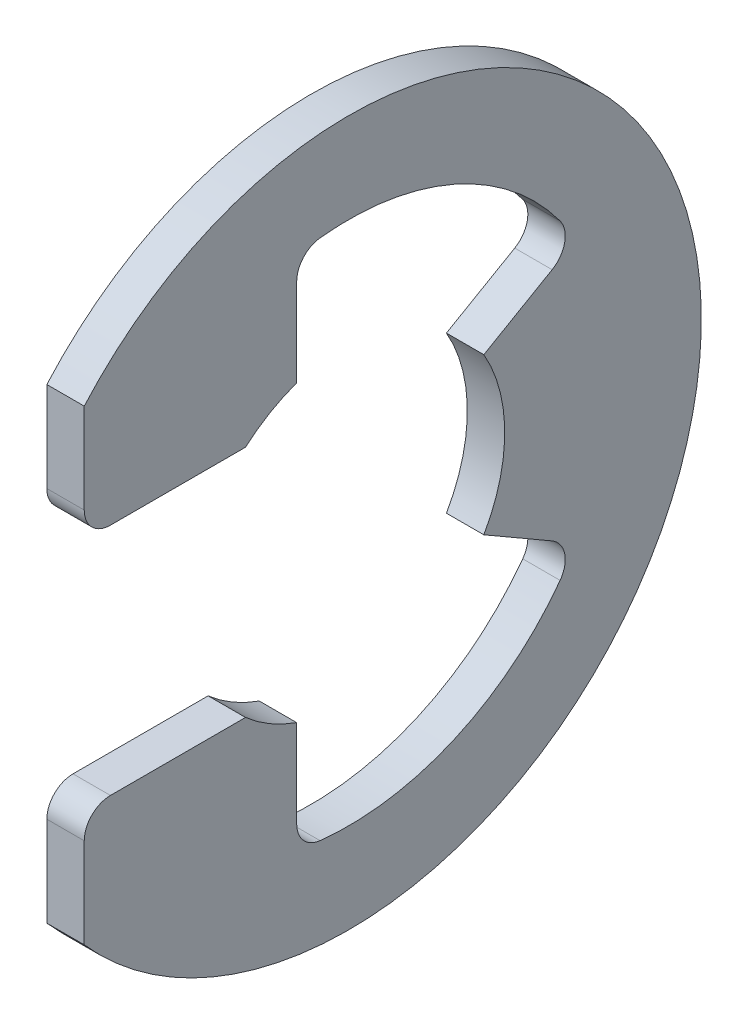
ISO-10303-21;
HEADER;
FILE_DESCRIPTION(('STEP AP214'),'2;1');
FILE_NAME('part.step','',(''),(''),'','','');
FILE_SCHEMA(('AUTOMOTIVE_DESIGN { 1 0 10303 214 1 1 1 1 }'));
ENDSEC;
DATA;
#1=APPLICATION_CONTEXT('core data for automotive mechanical design processes');
#2=APPLICATION_PROTOCOL_DEFINITION('international standard','automotive_design',2000,#1);
#3=PRODUCT_CONTEXT('',#1,'mechanical');
#4=PRODUCT('Part','Part','',(#3));
#5=PRODUCT_RELATED_PRODUCT_CATEGORY('part','',(#4));
#6=PRODUCT_DEFINITION_FORMATION('','',#4);
#7=PRODUCT_DEFINITION_CONTEXT('part definition',#1,'design');
#8=PRODUCT_DEFINITION('design','',#6,#7);
#9=PRODUCT_DEFINITION_SHAPE('','',#8);
#10=(LENGTH_UNIT() NAMED_UNIT(*) SI_UNIT(.MILLI.,.METRE.));
#11=(NAMED_UNIT(*) PLANE_ANGLE_UNIT() SI_UNIT($,.RADIAN.));
#12=(NAMED_UNIT(*) SI_UNIT($,.STERADIAN.) SOLID_ANGLE_UNIT());
#13=UNCERTAINTY_MEASURE_WITH_UNIT(LENGTH_MEASURE(1.E-05),#10,'distance_accuracy_value','');
#14=(GEOMETRIC_REPRESENTATION_CONTEXT(3) GLOBAL_UNCERTAINTY_ASSIGNED_CONTEXT((#13)) GLOBAL_UNIT_ASSIGNED_CONTEXT((#10,
#11,#12)) REPRESENTATION_CONTEXT('',''));
#15=CARTESIAN_POINT('',(0.,0.,0.));
#16=DIRECTION('',(0.,0.,1.));
#17=DIRECTION('',(1.,0.,0.));
#18=AXIS2_PLACEMENT_3D('',#15,#16,#17);
#19=CARTESIAN_POINT('',(0.4445,0.,0.));
#20=DIRECTION('',(-1.,0.,0.));
#21=DIRECTION('',(0.,0.,1.));
#22=AXIS2_PLACEMENT_3D('',#19,#20,#21);
#23=CYLINDRICAL_SURFACE('',#22,8.382);
#24=CARTESIAN_POINT('',(-0.4445,0.,0.));
#25=DIRECTION('',(1.,0.,0.));
#26=DIRECTION('',(0.,0.,-1.));
#27=AXIS2_PLACEMENT_3D('',#24,#25,#26);
#28=CIRCLE('',#27,8.382);
#29=CARTESIAN_POINT('',(-0.4445,-5.54417187233585,6.2865));
#30=VERTEX_POINT('',#29);
#31=CARTESIAN_POINT('',(-0.4445,5.54417187233585,6.2865));
#32=VERTEX_POINT('',#31);
#33=EDGE_CURVE('E194',#30,#32,#28,.T.);
#34=ORIENTED_EDGE('',*,*,#33,.T.);
#35=DIRECTION('',(-1.,0.,0.));
#36=VECTOR('',#35,1.);
#37=CARTESIAN_POINT('',(0.4445,5.54417187233585,6.2865));
#38=LINE('',#37,#36);
#39=CARTESIAN_POINT('',(0.4445,5.54417187233585,6.2865));
#40=VERTEX_POINT('',#39);
#41=EDGE_CURVE('E175',#40,#32,#38,.T.);
#42=ORIENTED_EDGE('',*,*,#41,.F.);
#43=CARTESIAN_POINT('',(0.4445,0.,0.));
#44=DIRECTION('',(1.,0.,0.));
#45=DIRECTION('',(0.,0.,-1.));
#46=AXIS2_PLACEMENT_3D('',#43,#44,#45);
#47=CIRCLE('',#46,8.382);
#48=CARTESIAN_POINT('',(0.4445,-5.54417187233585,6.2865));
#49=VERTEX_POINT('',#48);
#50=EDGE_CURVE('E181',#49,#40,#47,.T.);
#51=ORIENTED_EDGE('',*,*,#50,.F.);
#52=DIRECTION('',(-1.,0.,0.));
#53=VECTOR('',#52,1.);
#54=CARTESIAN_POINT('',(0.4445,-5.54417187233585,6.2865));
#55=LINE('',#54,#53);
#56=EDGE_CURVE('E296',#49,#30,#55,.T.);
#57=ORIENTED_EDGE('',*,*,#56,.T.);
#58=EDGE_LOOP('',(#34,#42,#51,#57));
#59=FACE_BOUND('',#58,.T.);
#60=ADVANCED_FACE('F32',(#59),#23,.T.);
#61=CARTESIAN_POINT('',(0.4445,5.54417187233585,6.2865));
#62=DIRECTION('',(0.,0.,-1.));
#63=DIRECTION('',(0.,1.,0.));
#64=AXIS2_PLACEMENT_3D('',#61,#62,#63);
#65=PLANE('',#64);
#66=DIRECTION('',(0.,-1.,0.));
#67=VECTOR('',#66,1.);
#68=CARTESIAN_POINT('',(-0.4445,5.54417187233585,6.2865));
#69=LINE('',#68,#67);
#70=CARTESIAN_POINT('',(-0.4445,3.4036,6.2865));
#71=VERTEX_POINT('',#70);
#72=EDGE_CURVE('E298',#32,#71,#69,.T.);
#73=ORIENTED_EDGE('',*,*,#72,.T.);
#74=DIRECTION('',(-1.,0.,0.));
#75=VECTOR('',#74,1.);
#76=CARTESIAN_POINT('',(0.4445,3.4036,6.2865));
#77=LINE('',#76,#75);
#78=CARTESIAN_POINT('',(0.4445,3.4036,6.2865));
#79=VERTEX_POINT('',#78);
#80=EDGE_CURVE('E178',#71,#79,#77,.F.);
#81=ORIENTED_EDGE('',*,*,#80,.T.);
#82=DIRECTION('',(0.,-1.,0.));
#83=VECTOR('',#82,1.);
#84=CARTESIAN_POINT('',(0.4445,5.54417187233585,6.2865));
#85=LINE('',#84,#83);
#86=EDGE_CURVE('E170',#40,#79,#85,.T.);
#87=ORIENTED_EDGE('',*,*,#86,.F.);
#88=ORIENTED_EDGE('',*,*,#41,.T.);
#89=EDGE_LOOP('',(#73,#81,#87,#88));
#90=FACE_BOUND('',#89,.T.);
#91=ADVANCED_FACE('F173',(#90),#65,.F.);
#92=CARTESIAN_POINT('',(0.4445,2.7813,2.45287604048798));
#93=DIRECTION('',(0.,1.,0.));
#94=DIRECTION('',(0.,0.,1.));
#95=AXIS2_PLACEMENT_3D('',#92,#93,#94);
#96=PLANE('',#95);
#97=DIRECTION('',(0.,0.,-1.));
#98=VECTOR('',#97,1.);
#99=CARTESIAN_POINT('',(0.4445,2.7813,2.45287604048798));
#100=LINE('',#99,#98);
#101=CARTESIAN_POINT('',(0.4445,2.7813,5.6642));
#102=VERTEX_POINT('',#101);
#103=CARTESIAN_POINT('',(0.4445,2.7813,2.45287604048798));
#104=VERTEX_POINT('',#103);
#105=EDGE_CURVE('E180',#102,#104,#100,.T.);
#106=ORIENTED_EDGE('',*,*,#105,.F.);
#107=DIRECTION('',(-1.,0.,0.));
#108=VECTOR('',#107,1.);
#109=CARTESIAN_POINT('',(0.4445,2.7813,5.6642));
#110=LINE('',#109,#108);
#111=CARTESIAN_POINT('',(-0.4445,2.7813,5.6642));
#112=VERTEX_POINT('',#111);
#113=EDGE_CURVE('E222',#102,#112,#110,.T.);
#114=ORIENTED_EDGE('',*,*,#113,.T.);
#115=DIRECTION('',(0.,0.,-1.));
#116=VECTOR('',#115,1.);
#117=CARTESIAN_POINT('',(-0.4445,2.7813,2.45287604048798));
#118=LINE('',#117,#116);
#119=CARTESIAN_POINT('',(-0.4445,2.7813,2.45287604048798));
#120=VERTEX_POINT('',#119);
#121=EDGE_CURVE('E300',#112,#120,#118,.T.);
#122=ORIENTED_EDGE('',*,*,#121,.T.);
#123=DIRECTION('',(-1.,0.,0.));
#124=VECTOR('',#123,1.);
#125=CARTESIAN_POINT('',(0.4445,2.7813,2.45287604048798));
#126=LINE('',#125,#124);
#127=EDGE_CURVE('E196',#104,#120,#126,.T.);
#128=ORIENTED_EDGE('',*,*,#127,.F.);
#129=EDGE_LOOP('',(#106,#114,#122,#128));
#130=FACE_BOUND('',#129,.T.);
#131=ADVANCED_FACE('F354',(#130),#96,.F.);
#132=CARTESIAN_POINT('',(0.4445,0.,0.));
#133=DIRECTION('',(-1.,0.,0.));
#134=DIRECTION('',(0.,0.,1.));
#135=AXIS2_PLACEMENT_3D('',#132,#133,#134);
#136=CYLINDRICAL_SURFACE('',#135,3.7084);
#137=CARTESIAN_POINT('',(-0.4445,0.,0.));
#138=DIRECTION('',(-1.,0.,0.));
#139=DIRECTION('',(0.,0.,1.));
#140=AXIS2_PLACEMENT_3D('',#137,#138,#139);
#141=CIRCLE('',#140,3.7084);
#142=CARTESIAN_POINT('',(-0.4445,3.49631304980292,1.23613333333333));
#143=VERTEX_POINT('',#142);
#144=EDGE_CURVE('E302',#120,#143,#141,.T.);
#145=ORIENTED_EDGE('',*,*,#144,.T.);
#146=DIRECTION('',(-1.,0.,0.));
#147=VECTOR('',#146,1.);
#148=CARTESIAN_POINT('',(0.4445,3.49631304980292,1.23613333333333));
#149=LINE('',#148,#147);
#150=CARTESIAN_POINT('',(0.4445,3.49631304980292,1.23613333333333));
#151=VERTEX_POINT('',#150);
#152=EDGE_CURVE('E202',#151,#143,#149,.T.);
#153=ORIENTED_EDGE('',*,*,#152,.F.);
#154=CARTESIAN_POINT('',(0.4445,0.,0.));
#155=DIRECTION('',(-1.,0.,0.));
#156=DIRECTION('',(0.,0.,1.));
#157=AXIS2_PLACEMENT_3D('',#154,#155,#156);
#158=CIRCLE('',#157,3.7084);
#159=EDGE_CURVE('E347',#104,#151,#158,.T.);
#160=ORIENTED_EDGE('',*,*,#159,.F.);
#161=ORIENTED_EDGE('',*,*,#127,.T.);
#162=EDGE_LOOP('',(#145,#153,#160,#161));
#163=FACE_BOUND('',#162,.T.);
#164=ADVANCED_FACE('F355',(#163),#136,.F.);
#165=CARTESIAN_POINT('',(0.4445,6.1165473055453,1.23613333333333));
#166=DIRECTION('',(0.,0.,1.));
#167=DIRECTION('',(0.,-1.,0.));
#168=AXIS2_PLACEMENT_3D('',#165,#166,#167);
#169=PLANE('',#168);
#170=DIRECTION('',(0.,1.,0.));
#171=VECTOR('',#170,1.);
#172=CARTESIAN_POINT('',(-0.4445,6.1165473055453,1.23613333333333));
#173=LINE('',#172,#171);
#174=CARTESIAN_POINT('',(-0.4445,5.58427090477913,1.23613333333333));
#175=VERTEX_POINT('',#174);
#176=EDGE_CURVE('E265',#143,#175,#173,.T.);
#177=ORIENTED_EDGE('',*,*,#176,.T.);
#178=DIRECTION('',(1.,0.,0.));
#179=VECTOR('',#178,1.);
#180=CARTESIAN_POINT('',(0.4445,5.58427090477913,1.23613333333333));
#181=LINE('',#180,#179);
#182=CARTESIAN_POINT('',(0.4445,5.58427090477913,1.23613333333333));
#183=VERTEX_POINT('',#182);
#184=EDGE_CURVE('E231',#175,#183,#181,.T.);
#185=ORIENTED_EDGE('',*,*,#184,.T.);
#186=DIRECTION('',(0.,1.,0.));
#187=VECTOR('',#186,1.);
#188=CARTESIAN_POINT('',(0.4445,6.1165473055453,1.23613333333333));
#189=LINE('',#188,#187);
#190=EDGE_CURVE('E281',#151,#183,#189,.T.);
#191=ORIENTED_EDGE('',*,*,#190,.F.);
#192=ORIENTED_EDGE('',*,*,#152,.T.);
#193=EDGE_LOOP('',(#177,#185,#191,#192));
#194=FACE_BOUND('',#193,.T.);
#195=ADVANCED_FACE('F337',(#194),#169,.F.);
#196=CARTESIAN_POINT('',(0.4445,0.,0.));
#197=DIRECTION('',(-1.,0.,0.));
#198=DIRECTION('',(0.,0.,1.));
#199=AXIS2_PLACEMENT_3D('',#196,#197,#198);
#200=CYLINDRICAL_SURFACE('',#199,6.2402064516129);
#201=CARTESIAN_POINT('',(0.4445,0.,0.));
#202=DIRECTION('',(-1.,0.,0.));
#203=DIRECTION('',(0.,0.,-1.));
#204=AXIS2_PLACEMENT_3D('',#201,#202,#203);
#205=CIRCLE('',#204,6.2402064516129);
#206=CARTESIAN_POINT('',(0.4445,6.20284506829984,0.681828143610685));
#207=VERTEX_POINT('',#206);
#208=CARTESIAN_POINT('',(0.4445,3.69952709627895,-5.02530355527397));
#209=VERTEX_POINT('',#208);
#210=EDGE_CURVE('E271',#207,#209,#205,.T.);
#211=ORIENTED_EDGE('',*,*,#210,.F.);
#212=DIRECTION('',(-1.,0.,0.));
#213=VECTOR('',#212,1.);
#214=CARTESIAN_POINT('',(0.4445,6.20284506829984,0.681828143610685));
#215=LINE('',#214,#213);
#216=CARTESIAN_POINT('',(-0.4445,6.20284506829984,0.681828143610685));
#217=VERTEX_POINT('',#216);
#218=EDGE_CURVE('E228',#207,#217,#215,.T.);
#219=ORIENTED_EDGE('',*,*,#218,.T.);
#220=CARTESIAN_POINT('',(-0.4445,0.,0.));
#221=DIRECTION('',(-1.,0.,0.));
#222=DIRECTION('',(0.,0.,-1.));
#223=AXIS2_PLACEMENT_3D('',#220,#221,#222);
#224=CIRCLE('',#223,6.2402064516129);
#225=CARTESIAN_POINT('',(-0.4445,3.69952709627895,-5.02530355527397));
#226=VERTEX_POINT('',#225);
#227=EDGE_CURVE('E254',#217,#226,#224,.T.);
#228=ORIENTED_EDGE('',*,*,#227,.T.);
#229=DIRECTION('',(-1.,0.,0.));
#230=VECTOR('',#229,1.);
#231=CARTESIAN_POINT('',(0.4445,3.69952709627894,-5.02530355527397));
#232=LINE('',#231,#230);
#233=EDGE_CURVE('E226',#226,#209,#232,.F.);
#234=ORIENTED_EDGE('',*,*,#233,.T.);
#235=EDGE_LOOP('',(#211,#219,#228,#234));
#236=FACE_BOUND('',#235,.T.);
#237=ADVANCED_FACE('F262',(#236),#200,.F.);
#238=CARTESIAN_POINT('',(0.4445,1.8542,-3.21156860739421));
#239=DIRECTION('',(0.,-0.866025403784438,-0.500000000000001));
#240=DIRECTION('',(0.,0.500000000000001,-0.866025403784438));
#241=AXIS2_PLACEMENT_3D('',#238,#239,#240);
#242=PLANE('',#241);
#243=DIRECTION('',(0.,-0.500000000000001,0.866025403784438));
#244=VECTOR('',#243,1.);
#245=CARTESIAN_POINT('',(0.4445,1.8542,-3.21156860739421));
#246=LINE('',#245,#244);
#247=CARTESIAN_POINT('',(0.4445,2.79166686806798,-4.83530885330041));
#248=VERTEX_POINT('',#247);
#249=CARTESIAN_POINT('',(0.4445,1.8542,-3.21156860739421));
#250=VERTEX_POINT('',#249);
#251=EDGE_CURVE('E269',#248,#250,#246,.T.);
#252=ORIENTED_EDGE('',*,*,#251,.F.);
#253=DIRECTION('',(1.,0.,0.));
#254=VECTOR('',#253,1.);
#255=CARTESIAN_POINT('',(-0.4445,2.79166686806798,-4.83530885330041));
#256=LINE('',#255,#254);
#257=CARTESIAN_POINT('',(-0.4445,2.79166686806798,-4.83530885330041));
#258=VERTEX_POINT('',#257);
#259=EDGE_CURVE('E235',#248,#258,#256,.F.);
#260=ORIENTED_EDGE('',*,*,#259,.T.);
#261=DIRECTION('',(0.,-0.500000000000001,0.866025403784438));
#262=VECTOR('',#261,1.);
#263=CARTESIAN_POINT('',(-0.4445,1.8542,-3.21156860739421));
#264=LINE('',#263,#262);
#265=CARTESIAN_POINT('',(-0.4445,1.8542,-3.21156860739421));
#266=VERTEX_POINT('',#265);
#267=EDGE_CURVE('E256',#258,#266,#264,.T.);
#268=ORIENTED_EDGE('',*,*,#267,.T.);
#269=DIRECTION('',(-1.,0.,0.));
#270=VECTOR('',#269,1.);
#271=CARTESIAN_POINT('',(0.4445,1.8542,-3.21156860739421));
#272=LINE('',#271,#270);
#273=EDGE_CURVE('E275',#250,#266,#272,.T.);
#274=ORIENTED_EDGE('',*,*,#273,.F.);
#275=EDGE_LOOP('',(#252,#260,#268,#274));
#276=FACE_BOUND('',#275,.T.);
#277=ADVANCED_FACE('F273',(#276),#242,.F.);
#278=CARTESIAN_POINT('',(0.4445,0.,0.));
#279=DIRECTION('',(-1.,0.,0.));
#280=DIRECTION('',(0.,0.,1.));
#281=AXIS2_PLACEMENT_3D('',#278,#279,#280);
#282=CYLINDRICAL_SURFACE('',#281,3.7084);
#283=CARTESIAN_POINT('',(-0.4445,0.,0.));
#284=DIRECTION('',(-1.,0.,0.));
#285=DIRECTION('',(0.,0.,1.));
#286=AXIS2_PLACEMENT_3D('',#283,#284,#285);
#287=CIRCLE('',#286,3.7084);
#288=CARTESIAN_POINT('',(-0.4445,-1.8542,-3.21156860739421));
#289=VERTEX_POINT('',#288);
#290=EDGE_CURVE('E307',#266,#289,#287,.T.);
#291=ORIENTED_EDGE('',*,*,#290,.T.);
#292=DIRECTION('',(-1.,0.,0.));
#293=VECTOR('',#292,1.);
#294=CARTESIAN_POINT('',(0.4445,-1.8542,-3.21156860739421));
#295=LINE('',#294,#293);
#296=CARTESIAN_POINT('',(0.4445,-1.8542,-3.21156860739421));
#297=VERTEX_POINT('',#296);
#298=EDGE_CURVE('E329',#297,#289,#295,.T.);
#299=ORIENTED_EDGE('',*,*,#298,.F.);
#300=CARTESIAN_POINT('',(0.4445,0.,0.));
#301=DIRECTION('',(-1.,0.,0.));
#302=DIRECTION('',(0.,0.,1.));
#303=AXIS2_PLACEMENT_3D('',#300,#301,#302);
#304=CIRCLE('',#303,3.7084);
#305=EDGE_CURVE('E277',#250,#297,#304,.T.);
#306=ORIENTED_EDGE('',*,*,#305,.F.);
#307=ORIENTED_EDGE('',*,*,#273,.T.);
#308=EDGE_LOOP('',(#291,#299,#306,#307));
#309=FACE_BOUND('',#308,.T.);
#310=ADVANCED_FACE('F435',(#309),#282,.F.);
#311=CARTESIAN_POINT('',(0.4445,-1.8542,-3.21156860739421));
#312=DIRECTION('',(0.,0.866025403784438,-0.500000000000001));
#313=DIRECTION('',(0.,0.500000000000001,0.866025403784438));
#314=AXIS2_PLACEMENT_3D('',#311,#312,#313);
#315=PLANE('',#314);
#316=DIRECTION('',(0.,-0.500000000000001,-0.866025403784438));
#317=VECTOR('',#316,1.);
#318=CARTESIAN_POINT('',(-0.4445,-1.8542,-3.21156860739421));
#319=LINE('',#318,#317);
#320=CARTESIAN_POINT('',(-0.4445,-2.79166686806798,-4.83530885330041));
#321=VERTEX_POINT('',#320);
#322=EDGE_CURVE('E309',#289,#321,#319,.T.);
#323=ORIENTED_EDGE('',*,*,#322,.T.);
#324=DIRECTION('',(1.,0.,0.));
#325=VECTOR('',#324,1.);
#326=CARTESIAN_POINT('',(0.4445,-2.79166686806798,-4.83530885330041));
#327=LINE('',#326,#325);
#328=CARTESIAN_POINT('',(0.4445,-2.79166686806798,-4.83530885330041));
#329=VERTEX_POINT('',#328);
#330=EDGE_CURVE('E233',#321,#329,#327,.T.);
#331=ORIENTED_EDGE('',*,*,#330,.T.);
#332=DIRECTION('',(0.,-0.500000000000001,-0.866025403784438));
#333=VECTOR('',#332,1.);
#334=CARTESIAN_POINT('',(0.4445,-1.8542,-3.21156860739421));
#335=LINE('',#334,#333);
#336=EDGE_CURVE('E279',#297,#329,#335,.T.);
#337=ORIENTED_EDGE('',*,*,#336,.F.);
#338=ORIENTED_EDGE('',*,*,#298,.T.);
#339=EDGE_LOOP('',(#323,#331,#337,#338));
#340=FACE_BOUND('',#339,.T.);
#341=ADVANCED_FACE('F432',(#340),#315,.F.);
#342=CARTESIAN_POINT('',(0.4445,0.,0.));
#343=DIRECTION('',(-1.,0.,0.));
#344=DIRECTION('',(0.,0.,1.));
#345=AXIS2_PLACEMENT_3D('',#342,#343,#344);
#346=CYLINDRICAL_SURFACE('',#345,6.2402064516129);
#347=CARTESIAN_POINT('',(-0.4445,0.,0.));
#348=DIRECTION('',(-1.,0.,0.));
#349=DIRECTION('',(0.,0.,-1.));
#350=AXIS2_PLACEMENT_3D('',#347,#348,#349);
#351=CIRCLE('',#350,6.2402064516129);
#352=CARTESIAN_POINT('',(-0.4445,-3.69952709627894,-5.02530355527397));
#353=VERTEX_POINT('',#352);
#354=CARTESIAN_POINT('',(-0.4445,-6.20284506829984,0.681828143610683));
#355=VERTEX_POINT('',#354);
#356=EDGE_CURVE('E312',#353,#355,#351,.T.);
#357=ORIENTED_EDGE('',*,*,#356,.T.);
#358=DIRECTION('',(-1.,0.,0.));
#359=VECTOR('',#358,1.);
#360=CARTESIAN_POINT('',(0.4445,-6.20284506829984,0.681828143610683));
#361=LINE('',#360,#359);
#362=CARTESIAN_POINT('',(0.4445,-6.20284506829984,0.681828143610683));
#363=VERTEX_POINT('',#362);
#364=EDGE_CURVE('E55',#355,#363,#361,.F.);
#365=ORIENTED_EDGE('',*,*,#364,.T.);
#366=CARTESIAN_POINT('',(0.4445,0.,0.));
#367=DIRECTION('',(-1.,0.,0.));
#368=DIRECTION('',(0.,0.,-1.));
#369=AXIS2_PLACEMENT_3D('',#366,#367,#368);
#370=CIRCLE('',#369,6.2402064516129);
#371=CARTESIAN_POINT('',(0.4445,-3.69952709627894,-5.02530355527397));
#372=VERTEX_POINT('',#371);
#373=EDGE_CURVE('E287',#372,#363,#370,.T.);
#374=ORIENTED_EDGE('',*,*,#373,.F.);
#375=DIRECTION('',(-1.,0.,0.));
#376=VECTOR('',#375,1.);
#377=CARTESIAN_POINT('',(0.4445,-3.69952709627894,-5.02530355527397));
#378=LINE('',#377,#376);
#379=EDGE_CURVE('E218',#372,#353,#378,.T.);
#380=ORIENTED_EDGE('',*,*,#379,.T.);
#381=EDGE_LOOP('',(#357,#365,#374,#380));
#382=FACE_BOUND('',#381,.T.);
#383=ADVANCED_FACE('F394',(#382),#346,.F.);
#384=CARTESIAN_POINT('',(0.4445,-3.49631304980292,1.23613333333333));
#385=DIRECTION('',(0.,0.,1.));
#386=DIRECTION('',(0.,-1.,0.));
#387=AXIS2_PLACEMENT_3D('',#384,#385,#386);
#388=PLANE('',#387);
#389=DIRECTION('',(0.,1.,0.));
#390=VECTOR('',#389,1.);
#391=CARTESIAN_POINT('',(0.4445,-3.49631304980292,1.23613333333333));
#392=LINE('',#391,#390);
#393=CARTESIAN_POINT('',(0.4445,-5.58427090477913,1.23613333333333));
#394=VERTEX_POINT('',#393);
#395=CARTESIAN_POINT('',(0.4445,-3.49631304980292,1.23613333333333));
#396=VERTEX_POINT('',#395);
#397=EDGE_CURVE('E289',#394,#396,#392,.T.);
#398=ORIENTED_EDGE('',*,*,#397,.F.);
#399=DIRECTION('',(1.,0.,0.));
#400=VECTOR('',#399,1.);
#401=CARTESIAN_POINT('',(-0.4445,-5.58427090477913,1.23613333333333));
#402=LINE('',#401,#400);
#403=CARTESIAN_POINT('',(-0.4445,-5.58427090477913,1.23613333333333));
#404=VERTEX_POINT('',#403);
#405=EDGE_CURVE('E215',#394,#404,#402,.F.);
#406=ORIENTED_EDGE('',*,*,#405,.T.);
#407=DIRECTION('',(0.,1.,0.));
#408=VECTOR('',#407,1.);
#409=CARTESIAN_POINT('',(-0.4445,-3.49631304980292,1.23613333333333));
#410=LINE('',#409,#408);
#411=CARTESIAN_POINT('',(-0.4445,-3.49631304980292,1.23613333333333));
#412=VERTEX_POINT('',#411);
#413=EDGE_CURVE('E314',#404,#412,#410,.T.);
#414=ORIENTED_EDGE('',*,*,#413,.T.);
#415=DIRECTION('',(-1.,0.,0.));
#416=VECTOR('',#415,1.);
#417=CARTESIAN_POINT('',(0.4445,-3.49631304980292,1.23613333333333));
#418=LINE('',#417,#416);
#419=EDGE_CURVE('E326',#396,#412,#418,.T.);
#420=ORIENTED_EDGE('',*,*,#419,.F.);
#421=EDGE_LOOP('',(#398,#406,#414,#420));
#422=FACE_BOUND('',#421,.T.);
#423=ADVANCED_FACE('F401',(#422),#388,.F.);
#424=CARTESIAN_POINT('',(0.4445,0.,0.));
#425=DIRECTION('',(-1.,0.,0.));
#426=DIRECTION('',(0.,0.,1.));
#427=AXIS2_PLACEMENT_3D('',#424,#425,#426);
#428=CYLINDRICAL_SURFACE('',#427,3.7084);
#429=CARTESIAN_POINT('',(-0.4445,0.,0.));
#430=DIRECTION('',(-1.,0.,0.));
#431=DIRECTION('',(0.,0.,-1.));
#432=AXIS2_PLACEMENT_3D('',#429,#430,#431);
#433=CIRCLE('',#432,3.7084);
#434=CARTESIAN_POINT('',(-0.4445,-2.7813,2.45287604048798));
#435=VERTEX_POINT('',#434);
#436=EDGE_CURVE('E316',#412,#435,#433,.T.);
#437=ORIENTED_EDGE('',*,*,#436,.T.);
#438=DIRECTION('',(-1.,0.,0.));
#439=VECTOR('',#438,1.);
#440=CARTESIAN_POINT('',(0.4445,-2.7813,2.45287604048798));
#441=LINE('',#440,#439);
#442=CARTESIAN_POINT('',(0.4445,-2.7813,2.45287604048798));
#443=VERTEX_POINT('',#442);
#444=EDGE_CURVE('E323',#443,#435,#441,.T.);
#445=ORIENTED_EDGE('',*,*,#444,.F.);
#446=CARTESIAN_POINT('',(0.4445,0.,0.));
#447=DIRECTION('',(-1.,0.,0.));
#448=DIRECTION('',(0.,0.,-1.));
#449=AXIS2_PLACEMENT_3D('',#446,#447,#448);
#450=CIRCLE('',#449,3.7084);
#451=EDGE_CURVE('E291',#396,#443,#450,.T.);
#452=ORIENTED_EDGE('',*,*,#451,.F.);
#453=ORIENTED_EDGE('',*,*,#419,.T.);
#454=EDGE_LOOP('',(#437,#445,#452,#453));
#455=FACE_BOUND('',#454,.T.);
#456=ADVANCED_FACE('F408',(#455),#428,.F.);
#457=CARTESIAN_POINT('',(0.4445,-2.7813,6.2865));
#458=DIRECTION('',(0.,-1.,0.));
#459=DIRECTION('',(0.,0.,-1.));
#460=AXIS2_PLACEMENT_3D('',#457,#458,#459);
#461=PLANE('',#460);
#462=DIRECTION('',(0.,0.,1.));
#463=VECTOR('',#462,1.);
#464=CARTESIAN_POINT('',(-0.4445,-2.7813,6.2865));
#465=LINE('',#464,#463);
#466=CARTESIAN_POINT('',(-0.4445,-2.7813,5.6642));
#467=VERTEX_POINT('',#466);
#468=EDGE_CURVE('E318',#435,#467,#465,.T.);
#469=ORIENTED_EDGE('',*,*,#468,.T.);
#470=DIRECTION('',(-1.,0.,0.));
#471=VECTOR('',#470,1.);
#472=CARTESIAN_POINT('',(0.4445,-2.7813,5.6642));
#473=LINE('',#472,#471);
#474=CARTESIAN_POINT('',(0.4445,-2.7813,5.6642));
#475=VERTEX_POINT('',#474);
#476=EDGE_CURVE('E209',#467,#475,#473,.F.);
#477=ORIENTED_EDGE('',*,*,#476,.T.);
#478=DIRECTION('',(0.,0.,1.));
#479=VECTOR('',#478,1.);
#480=CARTESIAN_POINT('',(0.4445,-2.7813,6.2865));
#481=LINE('',#480,#479);
#482=EDGE_CURVE('E293',#443,#475,#481,.T.);
#483=ORIENTED_EDGE('',*,*,#482,.F.);
#484=ORIENTED_EDGE('',*,*,#444,.T.);
#485=EDGE_LOOP('',(#469,#477,#483,#484));
#486=FACE_BOUND('',#485,.T.);
#487=ADVANCED_FACE('F411',(#486),#461,.F.);
#488=CARTESIAN_POINT('',(0.4445,-5.54417187233585,6.2865));
#489=DIRECTION('',(0.,0.,-1.));
#490=DIRECTION('',(-1.,0.,0.));
#491=AXIS2_PLACEMENT_3D('',#488,#489,#490);
#492=PLANE('',#491);
#493=DIRECTION('',(0.,-1.,0.));
#494=VECTOR('',#493,1.);
#495=CARTESIAN_POINT('',(0.4445,-5.54417187233585,6.2865));
#496=LINE('',#495,#494);
#497=CARTESIAN_POINT('',(0.4445,-3.4036,6.2865));
#498=VERTEX_POINT('',#497);
#499=EDGE_CURVE('E187',#498,#49,#496,.T.);
#500=ORIENTED_EDGE('',*,*,#499,.F.);
#501=DIRECTION('',(-1.,0.,0.));
#502=VECTOR('',#501,1.);
#503=CARTESIAN_POINT('',(0.4445,-3.4036,6.2865));
#504=LINE('',#503,#502);
#505=CARTESIAN_POINT('',(-0.4445,-3.4036,6.2865));
#506=VERTEX_POINT('',#505);
#507=EDGE_CURVE('E195',#498,#506,#504,.T.);
#508=ORIENTED_EDGE('',*,*,#507,.T.);
#509=DIRECTION('',(0.,-1.,0.));
#510=VECTOR('',#509,1.);
#511=CARTESIAN_POINT('',(-0.4445,-5.54417187233585,6.2865));
#512=LINE('',#511,#510);
#513=EDGE_CURVE('E191',#506,#30,#512,.T.);
#514=ORIENTED_EDGE('',*,*,#513,.T.);
#515=ORIENTED_EDGE('',*,*,#56,.F.);
#516=EDGE_LOOP('',(#500,#508,#514,#515));
#517=FACE_BOUND('',#516,.T.);
#518=ADVANCED_FACE('F415',(#517),#492,.F.);
#519=CARTESIAN_POINT('',(0.4445,0.,0.));
#520=DIRECTION('',(1.,0.,0.));
#521=DIRECTION('',(0.,0.,-1.));
#522=AXIS2_PLACEMENT_3D('',#519,#520,#521);
#523=PLANE('',#522);
#524=ORIENTED_EDGE('',*,*,#482,.T.);
#525=CARTESIAN_POINT('',(0.4445,-3.4036,5.6642));
#526=DIRECTION('',(1.,0.,0.));
#527=DIRECTION('',(0.,0.,-1.));
#528=AXIS2_PLACEMENT_3D('',#525,#526,#527);
#529=CIRCLE('',#528,0.6223);
#530=EDGE_CURVE('E213',#475,#498,#529,.T.);
#531=ORIENTED_EDGE('',*,*,#530,.T.);
#532=ORIENTED_EDGE('',*,*,#499,.T.);
#533=ORIENTED_EDGE('',*,*,#50,.T.);
#534=ORIENTED_EDGE('',*,*,#86,.T.);
#535=CARTESIAN_POINT('',(0.4445,3.4036,5.6642));
#536=DIRECTION('',(1.,0.,0.));
#537=DIRECTION('',(0.,0.,-1.));
#538=AXIS2_PLACEMENT_3D('',#535,#536,#537);
#539=CIRCLE('',#538,0.6223);
#540=EDGE_CURVE('E211',#79,#102,#539,.T.);
#541=ORIENTED_EDGE('',*,*,#540,.T.);
#542=ORIENTED_EDGE('',*,*,#105,.T.);
#543=ORIENTED_EDGE('',*,*,#159,.T.);
#544=ORIENTED_EDGE('',*,*,#190,.T.);
#545=CARTESIAN_POINT('',(0.4445,5.58427090477913,0.613833333333333));
#546=DIRECTION('',(1.,0.,0.));
#547=DIRECTION('',(0.,0.,-1.));
#548=AXIS2_PLACEMENT_3D('',#545,#546,#547);
#549=CIRCLE('',#548,0.6223);
#550=EDGE_CURVE('E243',#183,#207,#549,.F.);
#551=ORIENTED_EDGE('',*,*,#550,.T.);
#552=ORIENTED_EDGE('',*,*,#210,.T.);
#553=CARTESIAN_POINT('',(0.4445,3.33059447684304,-4.52415885330041));
#554=DIRECTION('',(1.,0.,0.));
#555=DIRECTION('',(0.,0.,-1.));
#556=AXIS2_PLACEMENT_3D('',#553,#554,#555);
#557=CIRCLE('',#556,0.6223);
#558=EDGE_CURVE('E11',#209,#248,#557,.F.);
#559=ORIENTED_EDGE('',*,*,#558,.T.);
#560=ORIENTED_EDGE('',*,*,#251,.T.);
#561=ORIENTED_EDGE('',*,*,#305,.T.);
#562=ORIENTED_EDGE('',*,*,#336,.T.);
#563=CARTESIAN_POINT('',(0.4445,-3.33059447684304,-4.52415885330041));
#564=DIRECTION('',(1.,0.,0.));
#565=DIRECTION('',(0.,0.,-1.));
#566=AXIS2_PLACEMENT_3D('',#563,#564,#565);
#567=CIRCLE('',#566,0.6223);
#568=EDGE_CURVE('E247',#329,#372,#567,.F.);
#569=ORIENTED_EDGE('',*,*,#568,.T.);
#570=ORIENTED_EDGE('',*,*,#373,.T.);
#571=CARTESIAN_POINT('',(0.4445,-5.58427090477913,0.613833333333331));
#572=DIRECTION('',(1.,0.,0.));
#573=DIRECTION('',(0.,0.,-1.));
#574=AXIS2_PLACEMENT_3D('',#571,#572,#573);
#575=CIRCLE('',#574,0.6223);
#576=EDGE_CURVE('E47',#363,#394,#575,.F.);
#577=ORIENTED_EDGE('',*,*,#576,.T.);
#578=ORIENTED_EDGE('',*,*,#397,.T.);
#579=ORIENTED_EDGE('',*,*,#451,.T.);
#580=EDGE_LOOP('',(#524,#531,#532,#533,#534,#541,#542,#543,#544,#551,#552,#559,#560,#561,#562,
#569,#570,#577,#578,#579));
#581=FACE_BOUND('',#580,.T.);
#582=ADVANCED_FACE('F185',(#581),#523,.T.);
#583=CARTESIAN_POINT('',(-0.4445,0.,0.));
#584=DIRECTION('',(1.,0.,0.));
#585=DIRECTION('',(0.,0.,-1.));
#586=AXIS2_PLACEMENT_3D('',#583,#584,#585);
#587=PLANE('',#586);
#588=ORIENTED_EDGE('',*,*,#513,.F.);
#589=CARTESIAN_POINT('',(-0.4445,-3.4036,5.6642));
#590=DIRECTION('',(1.,0.,0.));
#591=DIRECTION('',(0.,0.,-1.));
#592=AXIS2_PLACEMENT_3D('',#589,#590,#591);
#593=CIRCLE('',#592,0.6223);
#594=EDGE_CURVE('E207',#506,#467,#593,.F.);
#595=ORIENTED_EDGE('',*,*,#594,.T.);
#596=ORIENTED_EDGE('',*,*,#468,.F.);
#597=ORIENTED_EDGE('',*,*,#436,.F.);
#598=ORIENTED_EDGE('',*,*,#413,.F.);
#599=CARTESIAN_POINT('',(-0.4445,-5.58427090477913,0.613833333333331));
#600=DIRECTION('',(1.,0.,0.));
#601=DIRECTION('',(0.,0.,-1.));
#602=AXIS2_PLACEMENT_3D('',#599,#600,#601);
#603=CIRCLE('',#602,0.6223);
#604=EDGE_CURVE('E238',#404,#355,#603,.T.);
#605=ORIENTED_EDGE('',*,*,#604,.T.);
#606=ORIENTED_EDGE('',*,*,#356,.F.);
#607=CARTESIAN_POINT('',(-0.4445,-3.33059447684304,-4.52415885330041));
#608=DIRECTION('',(1.,0.,0.));
#609=DIRECTION('',(0.,0.,-1.));
#610=AXIS2_PLACEMENT_3D('',#607,#608,#609);
#611=CIRCLE('',#610,0.6223);
#612=EDGE_CURVE('E245',#353,#321,#611,.T.);
#613=ORIENTED_EDGE('',*,*,#612,.T.);
#614=ORIENTED_EDGE('',*,*,#322,.F.);
#615=ORIENTED_EDGE('',*,*,#290,.F.);
#616=ORIENTED_EDGE('',*,*,#267,.F.);
#617=CARTESIAN_POINT('',(-0.4445,3.33059447684304,-4.52415885330041));
#618=DIRECTION('',(1.,0.,0.));
#619=DIRECTION('',(0.,0.,-1.));
#620=AXIS2_PLACEMENT_3D('',#617,#618,#619);
#621=CIRCLE('',#620,0.6223);
#622=EDGE_CURVE('E40',#258,#226,#621,.T.);
#623=ORIENTED_EDGE('',*,*,#622,.T.);
#624=ORIENTED_EDGE('',*,*,#227,.F.);
#625=CARTESIAN_POINT('',(-0.4445,5.58427090477913,0.613833333333333));
#626=DIRECTION('',(1.,0.,0.));
#627=DIRECTION('',(0.,0.,-1.));
#628=AXIS2_PLACEMENT_3D('',#625,#626,#627);
#629=CIRCLE('',#628,0.6223);
#630=EDGE_CURVE('E241',#217,#175,#629,.T.);
#631=ORIENTED_EDGE('',*,*,#630,.T.);
#632=ORIENTED_EDGE('',*,*,#176,.F.);
#633=ORIENTED_EDGE('',*,*,#144,.F.);
#634=ORIENTED_EDGE('',*,*,#121,.F.);
#635=CARTESIAN_POINT('',(-0.4445,3.4036,5.6642));
#636=DIRECTION('',(1.,0.,0.));
#637=DIRECTION('',(0.,0.,-1.));
#638=AXIS2_PLACEMENT_3D('',#635,#636,#637);
#639=CIRCLE('',#638,0.6223);
#640=EDGE_CURVE('E199',#112,#71,#639,.F.);
#641=ORIENTED_EDGE('',*,*,#640,.T.);
#642=ORIENTED_EDGE('',*,*,#72,.F.);
#643=ORIENTED_EDGE('',*,*,#33,.F.);
#644=EDGE_LOOP('',(#588,#595,#596,#597,#598,#605,#606,#613,#614,#615,#616,#623,#624,#631,#632,
#633,#634,#641,#642,#643));
#645=FACE_BOUND('',#644,.T.);
#646=ADVANCED_FACE('F253',(#645),#587,.F.);
#647=CARTESIAN_POINT('',(0.4445,-3.4036,5.6642));
#648=DIRECTION('',(-1.,0.,0.));
#649=DIRECTION('',(0.,0.,1.));
#650=AXIS2_PLACEMENT_3D('',#647,#648,#649);
#651=CYLINDRICAL_SURFACE('',#650,0.6223);
#652=ORIENTED_EDGE('',*,*,#530,.F.);
#653=ORIENTED_EDGE('',*,*,#476,.F.);
#654=ORIENTED_EDGE('',*,*,#594,.F.);
#655=ORIENTED_EDGE('',*,*,#507,.F.);
#656=EDGE_LOOP('',(#652,#653,#654,#655));
#657=FACE_BOUND('',#656,.T.);
#658=ADVANCED_FACE('F371',(#657),#651,.T.);
#659=CARTESIAN_POINT('',(0.4445,-5.58427090477913,0.613833333333331));
#660=DIRECTION('',(-1.,0.,0.));
#661=DIRECTION('',(0.,0.,1.));
#662=AXIS2_PLACEMENT_3D('',#659,#660,#661);
#663=CYLINDRICAL_SURFACE('',#662,0.6223);
#664=ORIENTED_EDGE('',*,*,#576,.F.);
#665=ORIENTED_EDGE('',*,*,#364,.F.);
#666=ORIENTED_EDGE('',*,*,#604,.F.);
#667=ORIENTED_EDGE('',*,*,#405,.F.);
#668=EDGE_LOOP('',(#664,#665,#666,#667));
#669=FACE_BOUND('',#668,.T.);
#670=ADVANCED_FACE('F374',(#669),#663,.F.);
#671=CARTESIAN_POINT('',(0.4445,3.4036,5.6642));
#672=DIRECTION('',(-1.,0.,0.));
#673=DIRECTION('',(0.,0.,1.));
#674=AXIS2_PLACEMENT_3D('',#671,#672,#673);
#675=CYLINDRICAL_SURFACE('',#674,0.6223);
#676=ORIENTED_EDGE('',*,*,#540,.F.);
#677=ORIENTED_EDGE('',*,*,#80,.F.);
#678=ORIENTED_EDGE('',*,*,#640,.F.);
#679=ORIENTED_EDGE('',*,*,#113,.F.);
#680=EDGE_LOOP('',(#676,#677,#678,#679));
#681=FACE_BOUND('',#680,.T.);
#682=ADVANCED_FACE('F378',(#681),#675,.T.);
#683=CARTESIAN_POINT('',(0.4445,5.58427090477913,0.613833333333333));
#684=DIRECTION('',(-1.,0.,0.));
#685=DIRECTION('',(0.,0.,1.));
#686=AXIS2_PLACEMENT_3D('',#683,#684,#685);
#687=CYLINDRICAL_SURFACE('',#686,0.6223);
#688=ORIENTED_EDGE('',*,*,#550,.F.);
#689=ORIENTED_EDGE('',*,*,#184,.F.);
#690=ORIENTED_EDGE('',*,*,#630,.F.);
#691=ORIENTED_EDGE('',*,*,#218,.F.);
#692=EDGE_LOOP('',(#688,#689,#690,#691));
#693=FACE_BOUND('',#692,.T.);
#694=ADVANCED_FACE('F346',(#693),#687,.F.);
#695=CARTESIAN_POINT('',(0.4445,-3.33059447684304,-4.52415885330041));
#696=DIRECTION('',(-1.,0.,0.));
#697=DIRECTION('',(0.,0.,1.));
#698=AXIS2_PLACEMENT_3D('',#695,#696,#697);
#699=CYLINDRICAL_SURFACE('',#698,0.6223);
#700=ORIENTED_EDGE('',*,*,#568,.F.);
#701=ORIENTED_EDGE('',*,*,#330,.F.);
#702=ORIENTED_EDGE('',*,*,#612,.F.);
#703=ORIENTED_EDGE('',*,*,#379,.F.);
#704=EDGE_LOOP('',(#700,#701,#702,#703));
#705=FACE_BOUND('',#704,.T.);
#706=ADVANCED_FACE('F384',(#705),#699,.F.);
#707=CARTESIAN_POINT('',(0.4445,3.33059447684304,-4.52415885330041));
#708=DIRECTION('',(-1.,0.,0.));
#709=DIRECTION('',(0.,0.,1.));
#710=AXIS2_PLACEMENT_3D('',#707,#708,#709);
#711=CYLINDRICAL_SURFACE('',#710,0.6223);
#712=ORIENTED_EDGE('',*,*,#558,.F.);
#713=ORIENTED_EDGE('',*,*,#233,.F.);
#714=ORIENTED_EDGE('',*,*,#622,.F.);
#715=ORIENTED_EDGE('',*,*,#259,.F.);
#716=EDGE_LOOP('',(#712,#713,#714,#715));
#717=FACE_BOUND('',#716,.T.);
#718=ADVANCED_FACE('F34',(#717),#711,.F.);
#719=CLOSED_SHELL('',(#60,#91,#131,#164,#195,#237,#277,#310,#341,#383,#423,#456,#487,#518,#582,
#646,#658,#670,#682,#694,#706,#718));
#720=MANIFOLD_SOLID_BREP('B2',#719);
#721=ADVANCED_BREP_SHAPE_REPRESENTATION('',(#18,#720),#14);
#722=SHAPE_DEFINITION_REPRESENTATION(#9,#721);
ENDSEC;
END-ISO-10303-21;
